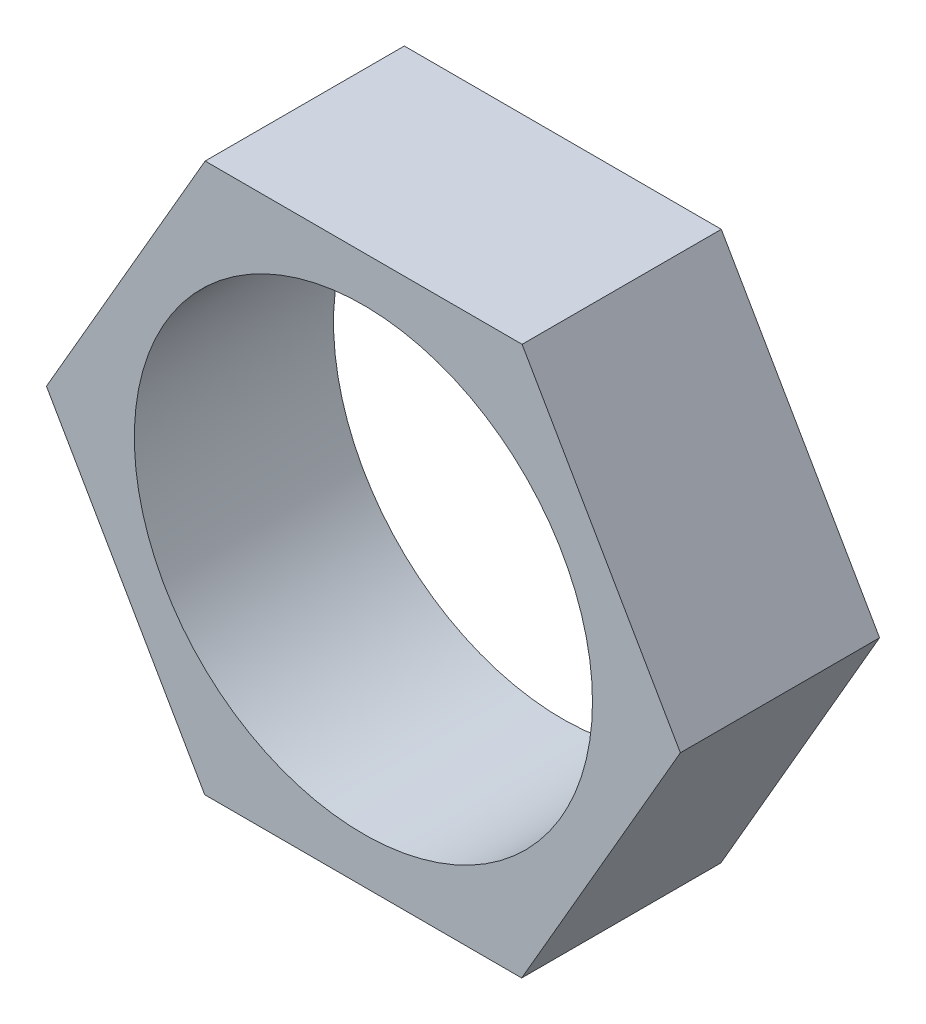
ISO-10303-21;
HEADER;
FILE_DESCRIPTION(('STEP AP214'),'2;1');
FILE_NAME('part.step','',(''),(''),'','','');
FILE_SCHEMA(('AUTOMOTIVE_DESIGN { 1 0 10303 214 1 1 1 1 }'));
ENDSEC;
DATA;
#1=APPLICATION_CONTEXT('core data for automotive mechanical design processes');
#2=APPLICATION_PROTOCOL_DEFINITION('international standard','automotive_design',2000,#1);
#3=PRODUCT_CONTEXT('',#1,'mechanical');
#4=PRODUCT('Part','Part','',(#3));
#5=PRODUCT_RELATED_PRODUCT_CATEGORY('part','',(#4));
#6=PRODUCT_DEFINITION_FORMATION('','',#4);
#7=PRODUCT_DEFINITION_CONTEXT('part definition',#1,'design');
#8=PRODUCT_DEFINITION('design','',#6,#7);
#9=PRODUCT_DEFINITION_SHAPE('','',#8);
#10=(LENGTH_UNIT() NAMED_UNIT(*) SI_UNIT(.MILLI.,.METRE.));
#11=(NAMED_UNIT(*) PLANE_ANGLE_UNIT() SI_UNIT($,.RADIAN.));
#12=(NAMED_UNIT(*) SI_UNIT($,.STERADIAN.) SOLID_ANGLE_UNIT());
#13=UNCERTAINTY_MEASURE_WITH_UNIT(LENGTH_MEASURE(1.E-05),#10,'distance_accuracy_value','');
#14=(GEOMETRIC_REPRESENTATION_CONTEXT(3) GLOBAL_UNCERTAINTY_ASSIGNED_CONTEXT((#13)) GLOBAL_UNIT_ASSIGNED_CONTEXT((#10,
#11,#12)) REPRESENTATION_CONTEXT('',''));
#15=CARTESIAN_POINT('',(0.,0.,0.));
#16=DIRECTION('',(0.,0.,1.));
#17=DIRECTION('',(1.,0.,0.));
#18=AXIS2_PLACEMENT_3D('',#15,#16,#17);
#19=CARTESIAN_POINT('',(0.,0.,10.));
#20=DIRECTION('',(0.,0.,1.));
#21=DIRECTION('',(1.,0.,0.));
#22=AXIS2_PLACEMENT_3D('',#19,#20,#21);
#23=PLANE('',#22);
#24=DIRECTION('',(-0.49931881181272,0.86641833092908,0.));
#25=VECTOR('',#24,1.);
#26=CARTESIAN_POINT('',(15.9123063577002,-0.0125132800354016,10.));
#27=LINE('',#26,#25);
#28=CARTESIAN_POINT('',(15.9123063577002,-0.0125132800354016,10.));
#29=VERTEX_POINT('',#28);
#30=CARTESIAN_POINT('',(7.96698999724545,13.7742048985513,10.));
#31=VERTEX_POINT('',#30);
#32=EDGE_CURVE('E129',#29,#31,#27,.T.);
#33=ORIENTED_EDGE('',*,*,#32,.T.);
#34=DIRECTION('',(-0.999999690795456,0.000786389847263397,0.));
#35=VECTOR('',#34,1.);
#36=CARTESIAN_POINT('',(7.96698999724545,13.7742048985513,10.));
#37=LINE('',#36,#35);
#38=CARTESIAN_POINT('',(-7.94531636045479,13.7867181785867,10.));
#39=VERTEX_POINT('',#38);
#40=EDGE_CURVE('E87',#31,#39,#37,.T.);
#41=ORIENTED_EDGE('',*,*,#40,.T.);
#42=DIRECTION('',(-0.500680878982736,-0.865631941081817,0.));
#43=VECTOR('',#42,1.);
#44=CARTESIAN_POINT('',(-7.94531636045479,13.7867181785867,10.));
#45=LINE('',#44,#43);
#46=CARTESIAN_POINT('',(-15.9123063577002,0.0125132800353981,10.));
#47=VERTEX_POINT('',#46);
#48=EDGE_CURVE('E100',#39,#47,#45,.T.);
#49=ORIENTED_EDGE('',*,*,#48,.T.);
#50=DIRECTION('',(0.49931881181272,-0.86641833092908,0.));
#51=VECTOR('',#50,1.);
#52=CARTESIAN_POINT('',(-15.9123063577002,0.0125132800353981,10.));
#53=LINE('',#52,#51);
#54=CARTESIAN_POINT('',(-7.96698999724544,-13.7742048985513,10.));
#55=VERTEX_POINT('',#54);
#56=EDGE_CURVE('E94',#47,#55,#53,.T.);
#57=ORIENTED_EDGE('',*,*,#56,.T.);
#58=DIRECTION('',(0.999999690795456,-0.000786389847263179,0.));
#59=VECTOR('',#58,1.);
#60=CARTESIAN_POINT('',(-7.96698999724544,-13.7742048985513,10.));
#61=LINE('',#60,#59);
#62=CARTESIAN_POINT('',(7.94531636045479,-13.7867181785867,10.));
#63=VERTEX_POINT('',#62);
#64=EDGE_CURVE('E98',#55,#63,#61,.T.);
#65=ORIENTED_EDGE('',*,*,#64,.T.);
#66=DIRECTION('',(0.500680878982736,0.865631941081817,0.));
#67=VECTOR('',#66,1.);
#68=CARTESIAN_POINT('',(7.94531636045479,-13.7867181785867,10.));
#69=LINE('',#68,#67);
#70=EDGE_CURVE('E50',#63,#29,#69,.T.);
#71=ORIENTED_EDGE('',*,*,#70,.T.);
#72=EDGE_LOOP('',(#33,#41,#49,#57,#65,#71));
#73=FACE_BOUND('',#72,.T.);
#74=CARTESIAN_POINT('',(0.,0.,10.));
#75=DIRECTION('',(0.,0.,1.));
#76=DIRECTION('',(1.,0.,0.));
#77=AXIS2_PLACEMENT_3D('',#74,#75,#76);
#78=CIRCLE('',#77,11.5);
#79=CARTESIAN_POINT('',(11.5,0.,10.));
#80=VERTEX_POINT('',#79);
#81=EDGE_CURVE('E122',#80,#80,#78,.T.);
#82=ORIENTED_EDGE('',*,*,#81,.F.);
#83=EDGE_LOOP('',(#82));
#84=FACE_BOUND('',#83,.T.);
#85=ADVANCED_FACE('F33',(#73,#84),#23,.T.);
#86=CARTESIAN_POINT('',(0.,0.,0.));
#87=DIRECTION('',(0.,0.,1.));
#88=DIRECTION('',(1.,0.,0.));
#89=AXIS2_PLACEMENT_3D('',#86,#87,#88);
#90=PLANE('',#89);
#91=DIRECTION('',(-0.49931881181272,0.86641833092908,0.));
#92=VECTOR('',#91,1.);
#93=CARTESIAN_POINT('',(15.9123063577002,-0.0125132800354016,0.));
#94=LINE('',#93,#92);
#95=CARTESIAN_POINT('',(15.9123063577002,-0.0125132800354016,0.));
#96=VERTEX_POINT('',#95);
#97=CARTESIAN_POINT('',(7.96698999724545,13.7742048985513,0.));
#98=VERTEX_POINT('',#97);
#99=EDGE_CURVE('E118',#96,#98,#94,.T.);
#100=ORIENTED_EDGE('',*,*,#99,.F.);
#101=DIRECTION('',(0.500680878982736,0.865631941081817,0.));
#102=VECTOR('',#101,1.);
#103=CARTESIAN_POINT('',(7.94531636045479,-13.7867181785867,0.));
#104=LINE('',#103,#102);
#105=CARTESIAN_POINT('',(7.94531636045479,-13.7867181785867,0.));
#106=VERTEX_POINT('',#105);
#107=EDGE_CURVE('E79',#106,#96,#104,.T.);
#108=ORIENTED_EDGE('',*,*,#107,.F.);
#109=DIRECTION('',(0.999999690795456,-0.000786389847263179,0.));
#110=VECTOR('',#109,1.);
#111=CARTESIAN_POINT('',(-7.96698999724544,-13.7742048985513,0.));
#112=LINE('',#111,#110);
#113=CARTESIAN_POINT('',(-7.96698999724544,-13.7742048985513,0.));
#114=VERTEX_POINT('',#113);
#115=EDGE_CURVE('E73',#114,#106,#112,.T.);
#116=ORIENTED_EDGE('',*,*,#115,.F.);
#117=DIRECTION('',(0.49931881181272,-0.86641833092908,0.));
#118=VECTOR('',#117,1.);
#119=CARTESIAN_POINT('',(-15.9123063577002,0.0125132800353981,0.));
#120=LINE('',#119,#118);
#121=CARTESIAN_POINT('',(-15.9123063577002,0.0125132800353981,0.));
#122=VERTEX_POINT('',#121);
#123=EDGE_CURVE('E108',#122,#114,#120,.T.);
#124=ORIENTED_EDGE('',*,*,#123,.F.);
#125=DIRECTION('',(-0.500680878982736,-0.865631941081817,0.));
#126=VECTOR('',#125,1.);
#127=CARTESIAN_POINT('',(-7.94531636045479,13.7867181785867,0.));
#128=LINE('',#127,#126);
#129=CARTESIAN_POINT('',(-7.94531636045479,13.7867181785867,0.));
#130=VERTEX_POINT('',#129);
#131=EDGE_CURVE('E124',#130,#122,#128,.T.);
#132=ORIENTED_EDGE('',*,*,#131,.F.);
#133=DIRECTION('',(-0.999999690795456,0.000786389847263397,0.));
#134=VECTOR('',#133,1.);
#135=CARTESIAN_POINT('',(7.96698999724545,13.7742048985513,0.));
#136=LINE('',#135,#134);
#137=EDGE_CURVE('E121',#98,#130,#136,.T.);
#138=ORIENTED_EDGE('',*,*,#137,.F.);
#139=EDGE_LOOP('',(#100,#108,#116,#124,#132,#138));
#140=FACE_BOUND('',#139,.T.);
#141=CARTESIAN_POINT('',(0.,0.,0.));
#142=DIRECTION('',(0.,0.,1.));
#143=DIRECTION('',(1.,0.,0.));
#144=AXIS2_PLACEMENT_3D('',#141,#142,#143);
#145=CIRCLE('',#144,11.5);
#146=CARTESIAN_POINT('',(11.5,0.,0.));
#147=VERTEX_POINT('',#146);
#148=EDGE_CURVE('E222',#147,#147,#145,.T.);
#149=ORIENTED_EDGE('',*,*,#148,.T.);
#150=EDGE_LOOP('',(#149));
#151=FACE_BOUND('',#150,.T.);
#152=ADVANCED_FACE('F138',(#140,#151),#90,.F.);
#153=CARTESIAN_POINT('',(15.9123063577002,-0.0125132800354016,10.));
#154=DIRECTION('',(-0.86641833092908,-0.49931881181272,0.));
#155=DIRECTION('',(0.49931881181272,-0.86641833092908,0.));
#156=AXIS2_PLACEMENT_3D('',#153,#154,#155);
#157=PLANE('',#156);
#158=ORIENTED_EDGE('',*,*,#99,.T.);
#159=DIRECTION('',(0.,0.,-1.));
#160=VECTOR('',#159,1.);
#161=CARTESIAN_POINT('',(7.96698999724545,13.7742048985513,10.));
#162=LINE('',#161,#160);
#163=EDGE_CURVE('E11',#31,#98,#162,.T.);
#164=ORIENTED_EDGE('',*,*,#163,.F.);
#165=ORIENTED_EDGE('',*,*,#32,.F.);
#166=DIRECTION('',(0.,0.,-1.));
#167=VECTOR('',#166,1.);
#168=CARTESIAN_POINT('',(15.9123063577002,-0.0125132800354016,10.));
#169=LINE('',#168,#167);
#170=EDGE_CURVE('E114',#29,#96,#169,.T.);
#171=ORIENTED_EDGE('',*,*,#170,.T.);
#172=EDGE_LOOP('',(#158,#164,#165,#171));
#173=FACE_BOUND('',#172,.T.);
#174=ADVANCED_FACE('F35',(#173),#157,.F.);
#175=CARTESIAN_POINT('',(7.96698999724545,13.7742048985513,10.));
#176=DIRECTION('',(-0.000786389847263397,-0.999999690795456,0.));
#177=DIRECTION('',(0.999999690795456,-0.000786389847263397,0.));
#178=AXIS2_PLACEMENT_3D('',#175,#176,#177);
#179=PLANE('',#178);
#180=ORIENTED_EDGE('',*,*,#137,.T.);
#181=DIRECTION('',(0.,0.,-1.));
#182=VECTOR('',#181,1.);
#183=CARTESIAN_POINT('',(-7.94531636045479,13.7867181785867,10.));
#184=LINE('',#183,#182);
#185=EDGE_CURVE('E42',#39,#130,#184,.T.);
#186=ORIENTED_EDGE('',*,*,#185,.F.);
#187=ORIENTED_EDGE('',*,*,#40,.F.);
#188=ORIENTED_EDGE('',*,*,#163,.T.);
#189=EDGE_LOOP('',(#180,#186,#187,#188));
#190=FACE_BOUND('',#189,.T.);
#191=ADVANCED_FACE('F163',(#190),#179,.F.);
#192=CARTESIAN_POINT('',(-7.94531636045479,13.7867181785867,10.));
#193=DIRECTION('',(0.865631941081817,-0.500680878982736,0.));
#194=DIRECTION('',(0.500680878982736,0.865631941081817,0.));
#195=AXIS2_PLACEMENT_3D('',#192,#193,#194);
#196=PLANE('',#195);
#197=ORIENTED_EDGE('',*,*,#131,.T.);
#198=DIRECTION('',(0.,0.,-1.));
#199=VECTOR('',#198,1.);
#200=CARTESIAN_POINT('',(-15.9123063577002,0.0125132800353981,10.));
#201=LINE('',#200,#199);
#202=EDGE_CURVE('E109',#47,#122,#201,.T.);
#203=ORIENTED_EDGE('',*,*,#202,.F.);
#204=ORIENTED_EDGE('',*,*,#48,.F.);
#205=ORIENTED_EDGE('',*,*,#185,.T.);
#206=EDGE_LOOP('',(#197,#203,#204,#205));
#207=FACE_BOUND('',#206,.T.);
#208=ADVANCED_FACE('F135',(#207),#196,.F.);
#209=CARTESIAN_POINT('',(-15.9123063577002,0.0125132800353981,10.));
#210=DIRECTION('',(0.86641833092908,0.49931881181272,0.));
#211=DIRECTION('',(-0.49931881181272,0.86641833092908,0.));
#212=AXIS2_PLACEMENT_3D('',#209,#210,#211);
#213=PLANE('',#212);
#214=ORIENTED_EDGE('',*,*,#123,.T.);
#215=DIRECTION('',(0.,0.,-1.));
#216=VECTOR('',#215,1.);
#217=CARTESIAN_POINT('',(-7.96698999724544,-13.7742048985513,10.));
#218=LINE('',#217,#216);
#219=EDGE_CURVE('E105',#55,#114,#218,.T.);
#220=ORIENTED_EDGE('',*,*,#219,.F.);
#221=ORIENTED_EDGE('',*,*,#56,.F.);
#222=ORIENTED_EDGE('',*,*,#202,.T.);
#223=EDGE_LOOP('',(#214,#220,#221,#222));
#224=FACE_BOUND('',#223,.T.);
#225=ADVANCED_FACE('F106',(#224),#213,.F.);
#226=CARTESIAN_POINT('',(-7.96698999724544,-13.7742048985513,10.));
#227=DIRECTION('',(0.000786389847263179,0.999999690795456,0.));
#228=DIRECTION('',(-0.999999690795456,0.000786389847263179,0.));
#229=AXIS2_PLACEMENT_3D('',#226,#227,#228);
#230=PLANE('',#229);
#231=ORIENTED_EDGE('',*,*,#115,.T.);
#232=DIRECTION('',(0.,0.,-1.));
#233=VECTOR('',#232,1.);
#234=CARTESIAN_POINT('',(7.94531636045479,-13.7867181785867,10.));
#235=LINE('',#234,#233);
#236=EDGE_CURVE('E110',#63,#106,#235,.T.);
#237=ORIENTED_EDGE('',*,*,#236,.F.);
#238=ORIENTED_EDGE('',*,*,#64,.F.);
#239=ORIENTED_EDGE('',*,*,#219,.T.);
#240=EDGE_LOOP('',(#231,#237,#238,#239));
#241=FACE_BOUND('',#240,.T.);
#242=ADVANCED_FACE('F112',(#241),#230,.F.);
#243=CARTESIAN_POINT('',(7.94531636045479,-13.7867181785867,10.));
#244=DIRECTION('',(-0.865631941081817,0.500680878982736,0.));
#245=DIRECTION('',(-0.500680878982736,-0.865631941081817,0.));
#246=AXIS2_PLACEMENT_3D('',#243,#244,#245);
#247=PLANE('',#246);
#248=ORIENTED_EDGE('',*,*,#107,.T.);
#249=ORIENTED_EDGE('',*,*,#170,.F.);
#250=ORIENTED_EDGE('',*,*,#70,.F.);
#251=ORIENTED_EDGE('',*,*,#236,.T.);
#252=EDGE_LOOP('',(#248,#249,#250,#251));
#253=FACE_BOUND('',#252,.T.);
#254=ADVANCED_FACE('F143',(#253),#247,.F.);
#255=CARTESIAN_POINT('',(0.,0.,10.));
#256=DIRECTION('',(0.,0.,-1.));
#257=DIRECTION('',(-1.,0.,0.));
#258=AXIS2_PLACEMENT_3D('',#255,#256,#257);
#259=CYLINDRICAL_SURFACE('',#258,11.5);
#260=ORIENTED_EDGE('',*,*,#81,.T.);
#261=EDGE_LOOP('',(#260));
#262=FACE_BOUND('',#261,.T.);
#263=ORIENTED_EDGE('',*,*,#148,.F.);
#264=EDGE_LOOP('',(#263));
#265=FACE_BOUND('',#264,.T.);
#266=ADVANCED_FACE('F145',(#262,#265),#259,.F.);
#267=CLOSED_SHELL('',(#85,#152,#174,#191,#208,#225,#242,#254,#266));
#268=MANIFOLD_SOLID_BREP('B2',#267);
#269=ADVANCED_BREP_SHAPE_REPRESENTATION('',(#18,#268),#14);
#270=SHAPE_DEFINITION_REPRESENTATION(#9,#269);
ENDSEC;
END-ISO-10303-21;
